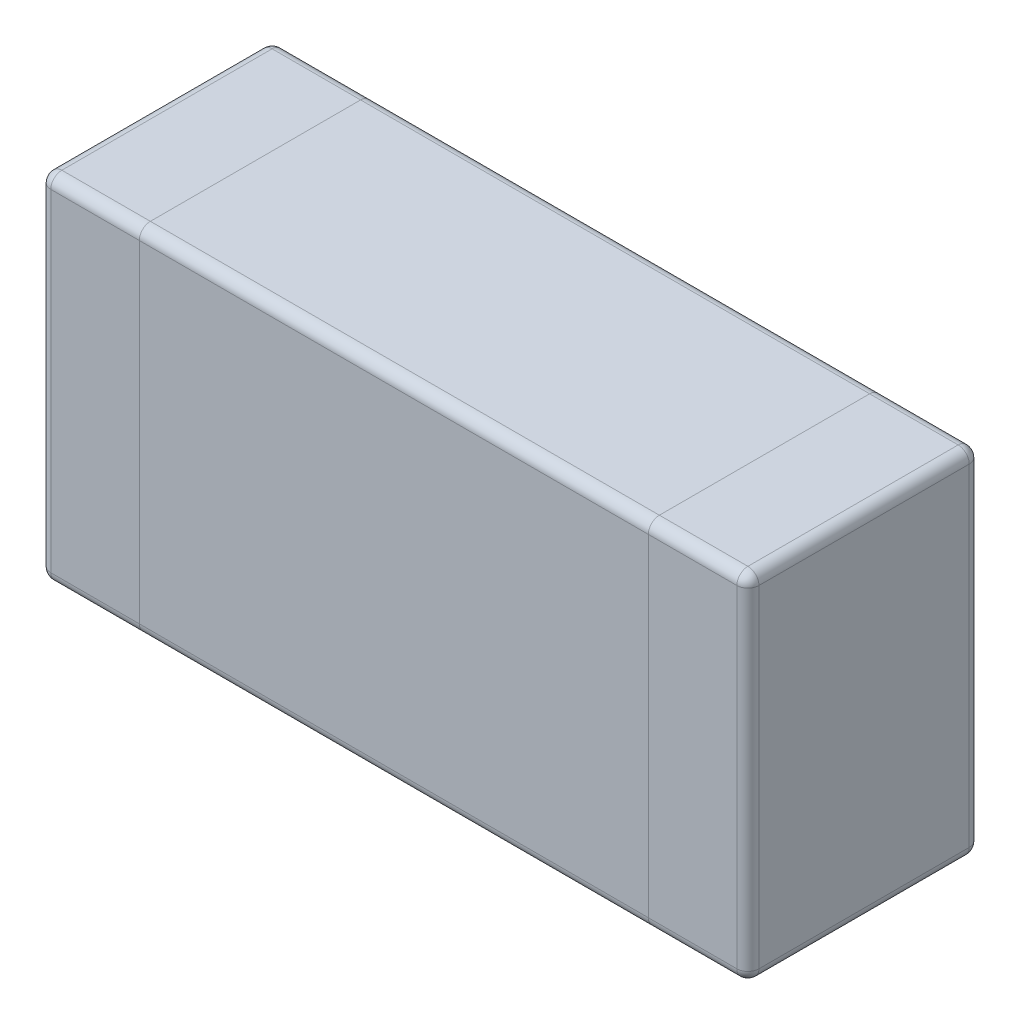
ISO-10303-21;
HEADER;
FILE_DESCRIPTION(('STEP AP214'),'2;1');
FILE_NAME('part.step','',(''),(''),'','','');
FILE_SCHEMA(('AUTOMOTIVE_DESIGN { 1 0 10303 214 1 1 1 1 }'));
ENDSEC;
DATA;
#1=APPLICATION_CONTEXT('core data for automotive mechanical design processes');
#2=APPLICATION_PROTOCOL_DEFINITION('international standard','automotive_design',2000,#1);
#3=PRODUCT_CONTEXT('',#1,'mechanical');
#4=PRODUCT('Part','Part','',(#3));
#5=PRODUCT_RELATED_PRODUCT_CATEGORY('part','',(#4));
#6=PRODUCT_DEFINITION_FORMATION('','',#4);
#7=PRODUCT_DEFINITION_CONTEXT('part definition',#1,'design');
#8=PRODUCT_DEFINITION('design','',#6,#7);
#9=PRODUCT_DEFINITION_SHAPE('','',#8);
#10=(LENGTH_UNIT() NAMED_UNIT(*) SI_UNIT(.MILLI.,.METRE.));
#11=(NAMED_UNIT(*) PLANE_ANGLE_UNIT() SI_UNIT($,.RADIAN.));
#12=(NAMED_UNIT(*) SI_UNIT($,.STERADIAN.) SOLID_ANGLE_UNIT());
#13=UNCERTAINTY_MEASURE_WITH_UNIT(LENGTH_MEASURE(1.E-05),#10,'distance_accuracy_value','');
#14=(GEOMETRIC_REPRESENTATION_CONTEXT(3) GLOBAL_UNCERTAINTY_ASSIGNED_CONTEXT((#13)) GLOBAL_UNIT_ASSIGNED_CONTEXT((#10,
#11,#12)) REPRESENTATION_CONTEXT('',''));
#15=CARTESIAN_POINT('',(0.,0.,0.));
#16=DIRECTION('',(0.,0.,1.));
#17=DIRECTION('',(1.,0.,0.));
#18=AXIS2_PLACEMENT_3D('',#15,#16,#17);
#19=CARTESIAN_POINT('',(1.55,0.749999999999718,1.0500000000002));
#20=DIRECTION('',(0.,2.68882138776405E-13,-1.));
#21=DIRECTION('',(0.,1.,2.68882138776405E-13));
#22=AXIS2_PLACEMENT_3D('',#19,#20,#21);
#23=CYLINDRICAL_SURFACE('',#22,0.05);
#24=CARTESIAN_POINT('',(1.55,0.749999999999731,1.0000000000002));
#25=DIRECTION('',(0.,2.68882138776405E-13,-1.));
#26=DIRECTION('',(0.,-1.,-2.68882138776405E-13));
#27=AXIS2_PLACEMENT_3D('',#24,#25,#26);
#28=CIRCLE('',#27,0.05);
#29=CARTESIAN_POINT('',(1.55,0.799999999999731,1.00000000000021));
#30=VERTEX_POINT('',#29);
#31=CARTESIAN_POINT('',(1.6,0.749999999999731,1.0000000000002));
#32=VERTEX_POINT('',#31);
#33=EDGE_CURVE('E25',#30,#32,#28,.T.);
#34=ORIENTED_EDGE('',*,*,#33,.T.);
#35=DIRECTION('',(0.,-2.68736422004423E-13,1.));
#36=VECTOR('',#35,1.);
#37=CARTESIAN_POINT('',(1.6,0.749999999999718,1.0500000000002));
#38=LINE('',#37,#36);
#39=CARTESIAN_POINT('',(1.6,0.749999999999987,0.0500000000002015));
#40=VERTEX_POINT('',#39);
#41=EDGE_CURVE('E207',#40,#32,#38,.T.);
#42=ORIENTED_EDGE('',*,*,#41,.F.);
#43=CARTESIAN_POINT('',(1.55,0.749999999999987,0.0500000000002015));
#44=DIRECTION('',(0.,-2.68746613504845E-13,1.));
#45=DIRECTION('',(0.,1.,2.68746613504845E-13));
#46=AXIS2_PLACEMENT_3D('',#43,#44,#45);
#47=CIRCLE('',#46,0.05);
#48=CARTESIAN_POINT('',(1.55,0.799999999999987,0.0500000000002149));
#49=VERTEX_POINT('',#48);
#50=EDGE_CURVE('E11',#40,#49,#47,.T.);
#51=ORIENTED_EDGE('',*,*,#50,.T.);
#52=DIRECTION('',(0.,2.68736422004423E-13,-1.));
#53=VECTOR('',#52,1.);
#54=CARTESIAN_POINT('',(1.55,0.799999999999718,1.05000000000021));
#55=LINE('',#54,#53);
#56=EDGE_CURVE('E209',#30,#49,#55,.T.);
#57=ORIENTED_EDGE('',*,*,#56,.F.);
#58=EDGE_LOOP('',(#34,#42,#51,#57));
#59=FACE_BOUND('',#58,.T.);
#60=ADVANCED_FACE('F17',(#59),#23,.T.);
#61=CARTESIAN_POINT('',(1.55,0.749999999999987,0.0500000000002016));
#62=DIRECTION('',(0.,-2.68736422004423E-13,1.));
#63=DIRECTION('',(1.,0.,0.));
#64=AXIS2_PLACEMENT_3D('',#61,#62,#63);
#65=SPHERICAL_SURFACE('',#64,0.05);
#66=CARTESIAN_POINT('',(1.55,0.749999999999987,0.0500000000002015));
#67=DIRECTION('',(0.,1.,2.68736422004423E-13));
#68=DIRECTION('',(-1.,0.,0.));
#69=AXIS2_PLACEMENT_3D('',#66,#67,#68);
#70=CIRCLE('',#69,0.05);
#71=CARTESIAN_POINT('',(1.55,0.75,2.01552316503317E-13));
#72=VERTEX_POINT('',#71);
#73=EDGE_CURVE('E196',#40,#72,#70,.T.);
#74=ORIENTED_EDGE('',*,*,#73,.T.);
#75=CARTESIAN_POINT('',(1.55,0.749999999999987,0.0500000000002016));
#76=DIRECTION('',(1.,0.,0.));
#77=DIRECTION('',(0.,1.,2.68746613504845E-13));
#78=AXIS2_PLACEMENT_3D('',#75,#76,#77);
#79=CIRCLE('',#78,0.05);
#80=EDGE_CURVE('E274',#72,#49,#79,.T.);
#81=ORIENTED_EDGE('',*,*,#80,.T.);
#82=ORIENTED_EDGE('',*,*,#50,.F.);
#83=EDGE_LOOP('',(#74,#81,#82));
#84=FACE_BOUND('',#83,.T.);
#85=ADVANCED_FACE('F625',(#84),#65,.T.);
#86=CARTESIAN_POINT('',(1.55,0.749999999999731,1.0000000000002));
#87=DIRECTION('',(0.,-2.68736422004423E-13,1.));
#88=DIRECTION('',(1.,0.,0.));
#89=AXIS2_PLACEMENT_3D('',#86,#87,#88);
#90=SPHERICAL_SURFACE('',#89,0.05);
#91=CARTESIAN_POINT('',(1.55,0.749999999999731,1.0000000000002));
#92=DIRECTION('',(1.,0.,0.));
#93=DIRECTION('',(0.,-2.68882138776406E-13,1.));
#94=AXIS2_PLACEMENT_3D('',#91,#92,#93);
#95=CIRCLE('',#94,0.05);
#96=CARTESIAN_POINT('',(1.55,0.749999999999718,1.0500000000002));
#97=VERTEX_POINT('',#96);
#98=EDGE_CURVE('E217',#30,#97,#95,.T.);
#99=ORIENTED_EDGE('',*,*,#98,.T.);
#100=CARTESIAN_POINT('',(1.55,0.749999999999731,1.0000000000002));
#101=DIRECTION('',(0.,1.,2.68736422004423E-13));
#102=DIRECTION('',(-1.,0.,0.));
#103=AXIS2_PLACEMENT_3D('',#100,#101,#102);
#104=CIRCLE('',#103,0.05);
#105=EDGE_CURVE('E192',#97,#32,#104,.T.);
#106=ORIENTED_EDGE('',*,*,#105,.T.);
#107=ORIENTED_EDGE('',*,*,#33,.F.);
#108=EDGE_LOOP('',(#99,#106,#107));
#109=FACE_BOUND('',#108,.T.);
#110=ADVANCED_FACE('F215',(#109),#90,.T.);
#111=CARTESIAN_POINT('',(1.55,-0.800000000000014,0.0499999999997849));
#112=DIRECTION('',(0.,-1.,-2.68736422004423E-13));
#113=DIRECTION('',(1.,0.,0.));
#114=AXIS2_PLACEMENT_3D('',#111,#112,#113);
#115=CYLINDRICAL_SURFACE('',#114,0.05);
#116=CARTESIAN_POINT('',(1.55,-0.750000000000014,0.0499999999997985));
#117=DIRECTION('',(0.,1.,2.68736422004423E-13));
#118=DIRECTION('',(1.,0.,0.));
#119=AXIS2_PLACEMENT_3D('',#116,#117,#118);
#120=CIRCLE('',#119,0.05);
#121=CARTESIAN_POINT('',(1.6,-0.750000000000014,0.0499999999997984));
#122=VERTEX_POINT('',#121);
#123=CARTESIAN_POINT('',(1.55,-0.75,-2.01552316503317E-13));
#124=VERTEX_POINT('',#123);
#125=EDGE_CURVE('E197',#122,#124,#120,.T.);
#126=ORIENTED_EDGE('',*,*,#125,.T.);
#127=DIRECTION('',(0.,-1.,-2.68736422004423E-13));
#128=VECTOR('',#127,1.);
#129=CARTESIAN_POINT('',(1.55,-0.8,-2.14989137603538E-13));
#130=LINE('',#129,#128);
#131=EDGE_CURVE('E327',#72,#124,#130,.T.);
#132=ORIENTED_EDGE('',*,*,#131,.F.);
#133=ORIENTED_EDGE('',*,*,#73,.F.);
#134=DIRECTION('',(0.,1.,2.68736422004423E-13));
#135=VECTOR('',#134,1.);
#136=CARTESIAN_POINT('',(1.6,0.799999999999987,0.0500000000002149));
#137=LINE('',#136,#135);
#138=EDGE_CURVE('E233',#122,#40,#137,.T.);
#139=ORIENTED_EDGE('',*,*,#138,.F.);
#140=EDGE_LOOP('',(#126,#132,#133,#139));
#141=FACE_BOUND('',#140,.T.);
#142=ADVANCED_FACE('F622',(#141),#115,.T.);
#143=CARTESIAN_POINT('',(-1.6,0.749999999999987,0.0500000000002015));
#144=DIRECTION('',(1.,0.,0.));
#145=DIRECTION('',(0.,1.,2.68746613504845E-13));
#146=AXIS2_PLACEMENT_3D('',#143,#144,#145);
#147=CYLINDRICAL_SURFACE('',#146,0.05);
#148=CARTESIAN_POINT('',(-1.15,0.749999999999987,0.0500000000002015));
#149=DIRECTION('',(-1.,0.,0.));
#150=DIRECTION('',(0.,1.,2.68746613504845E-13));
#151=AXIS2_PLACEMENT_3D('',#148,#149,#150);
#152=CIRCLE('',#151,0.05);
#153=CARTESIAN_POINT('',(-1.15,0.799999999999987,0.0500000000002149));
#154=VERTEX_POINT('',#153);
#155=CARTESIAN_POINT('',(-1.15,0.75,2.01552316503317E-13));
#156=VERTEX_POINT('',#155);
#157=EDGE_CURVE('E278',#154,#156,#152,.T.);
#158=ORIENTED_EDGE('',*,*,#157,.F.);
#159=DIRECTION('',(-1.,0.,0.));
#160=VECTOR('',#159,1.);
#161=CARTESIAN_POINT('',(-1.6,0.799999999999987,0.0500000000002149));
#162=LINE('',#161,#160);
#163=CARTESIAN_POINT('',(1.15,0.799999999999987,0.0500000000002149));
#164=VERTEX_POINT('',#163);
#165=EDGE_CURVE('E155',#164,#154,#162,.T.);
#166=ORIENTED_EDGE('',*,*,#165,.F.);
#167=CARTESIAN_POINT('',(1.15,0.749999999999987,0.0500000000002015));
#168=DIRECTION('',(1.,0.,0.));
#169=DIRECTION('',(0.,-1.,-2.68746613504845E-13));
#170=AXIS2_PLACEMENT_3D('',#167,#168,#169);
#171=CIRCLE('',#170,0.05);
#172=CARTESIAN_POINT('',(1.15,0.75,2.01552316503317E-13));
#173=VERTEX_POINT('',#172);
#174=EDGE_CURVE('E313',#173,#164,#171,.T.);
#175=ORIENTED_EDGE('',*,*,#174,.F.);
#176=DIRECTION('',(1.,0.,0.));
#177=VECTOR('',#176,1.);
#178=CARTESIAN_POINT('',(1.6,0.75,2.01552316503317E-13));
#179=LINE('',#178,#177);
#180=EDGE_CURVE('E174',#156,#173,#179,.T.);
#181=ORIENTED_EDGE('',*,*,#180,.F.);
#182=EDGE_LOOP('',(#158,#166,#175,#181));
#183=FACE_BOUND('',#182,.T.);
#184=ADVANCED_FACE('F279',(#183),#147,.T.);
#185=CARTESIAN_POINT('',(1.6,0.749999999999731,1.0000000000002));
#186=DIRECTION('',(-1.,0.,0.));
#187=DIRECTION('',(0.,-1.,-2.68882138776405E-13));
#188=AXIS2_PLACEMENT_3D('',#185,#186,#187);
#189=CYLINDRICAL_SURFACE('',#188,0.05);
#190=CARTESIAN_POINT('',(-1.15,0.749999999999731,1.0000000000002));
#191=DIRECTION('',(-1.,0.,0.));
#192=DIRECTION('',(0.,1.,2.68882138776405E-13));
#193=AXIS2_PLACEMENT_3D('',#190,#191,#192);
#194=CIRCLE('',#193,0.05);
#195=CARTESIAN_POINT('',(-1.15,0.749999999999718,1.0500000000002));
#196=VERTEX_POINT('',#195);
#197=CARTESIAN_POINT('',(-1.15,0.799999999999731,1.00000000000021));
#198=VERTEX_POINT('',#197);
#199=EDGE_CURVE('E331',#196,#198,#194,.T.);
#200=ORIENTED_EDGE('',*,*,#199,.F.);
#201=DIRECTION('',(-1.,0.,0.));
#202=VECTOR('',#201,1.);
#203=CARTESIAN_POINT('',(1.6,0.749999999999718,1.0500000000002));
#204=LINE('',#203,#202);
#205=CARTESIAN_POINT('',(1.15,0.749999999999718,1.0500000000002));
#206=VERTEX_POINT('',#205);
#207=EDGE_CURVE('E165',#206,#196,#204,.T.);
#208=ORIENTED_EDGE('',*,*,#207,.F.);
#209=CARTESIAN_POINT('',(1.15,0.749999999999731,1.0000000000002));
#210=DIRECTION('',(1.,0.,0.));
#211=DIRECTION('',(0.,-1.,-2.68882138776405E-13));
#212=AXIS2_PLACEMENT_3D('',#209,#210,#211);
#213=CIRCLE('',#212,0.05);
#214=CARTESIAN_POINT('',(1.15,0.799999999999731,1.00000000000021));
#215=VERTEX_POINT('',#214);
#216=EDGE_CURVE('E295',#215,#206,#213,.T.);
#217=ORIENTED_EDGE('',*,*,#216,.F.);
#218=DIRECTION('',(1.,0.,0.));
#219=VECTOR('',#218,1.);
#220=CARTESIAN_POINT('',(-1.6,0.799999999999731,1.00000000000021));
#221=LINE('',#220,#219);
#222=EDGE_CURVE('E146',#198,#215,#221,.T.);
#223=ORIENTED_EDGE('',*,*,#222,.F.);
#224=EDGE_LOOP('',(#200,#208,#217,#223));
#225=FACE_BOUND('',#224,.T.);
#226=ADVANCED_FACE('F612',(#225),#189,.T.);
#227=CARTESIAN_POINT('',(1.55,0.799999999999731,1.00000000000021));
#228=DIRECTION('',(0.,1.,2.68736422004423E-13));
#229=DIRECTION('',(-1.,0.,0.));
#230=AXIS2_PLACEMENT_3D('',#227,#228,#229);
#231=CYLINDRICAL_SURFACE('',#230,0.05);
#232=CARTESIAN_POINT('',(1.55,-0.750000000000269,0.999999999999799));
#233=DIRECTION('',(0.,1.,2.71050543121376E-13));
#234=DIRECTION('',(0.,2.71050543121376E-13,-1.));
#235=AXIS2_PLACEMENT_3D('',#232,#233,#234);
#236=CIRCLE('',#235,0.05);
#237=CARTESIAN_POINT('',(1.55,-0.750000000000283,1.0499999999998));
#238=VERTEX_POINT('',#237);
#239=CARTESIAN_POINT('',(1.6,-0.750000000000269,0.999999999999799));
#240=VERTEX_POINT('',#239);
#241=EDGE_CURVE('E191',#238,#240,#236,.T.);
#242=ORIENTED_EDGE('',*,*,#241,.T.);
#243=DIRECTION('',(0.,-1.,-2.68736422004423E-13));
#244=VECTOR('',#243,1.);
#245=CARTESIAN_POINT('',(1.6,-0.800000000000269,0.999999999999786));
#246=LINE('',#245,#244);
#247=EDGE_CURVE('E222',#32,#240,#246,.T.);
#248=ORIENTED_EDGE('',*,*,#247,.F.);
#249=ORIENTED_EDGE('',*,*,#105,.F.);
#250=DIRECTION('',(0.,1.,2.68736422004423E-13));
#251=VECTOR('',#250,1.);
#252=CARTESIAN_POINT('',(1.55,0.799999999999718,1.05000000000021));
#253=LINE('',#252,#251);
#254=EDGE_CURVE('E425',#238,#97,#253,.T.);
#255=ORIENTED_EDGE('',*,*,#254,.F.);
#256=EDGE_LOOP('',(#242,#248,#249,#255));
#257=FACE_BOUND('',#256,.T.);
#258=ADVANCED_FACE('F223',(#257),#231,.T.);
#259=CARTESIAN_POINT('',(1.55,-0.750000000000014,0.0499999999997985));
#260=DIRECTION('',(0.,-2.68736422004423E-13,1.));
#261=DIRECTION('',(1.,0.,0.));
#262=AXIS2_PLACEMENT_3D('',#259,#260,#261);
#263=SPHERICAL_SURFACE('',#262,0.05);
#264=CARTESIAN_POINT('',(1.55,-0.750000000000014,0.0499999999997984));
#265=DIRECTION('',(0.,2.68746613504845E-13,-1.));
#266=DIRECTION('',(0.,1.,2.68746613504845E-13));
#267=AXIS2_PLACEMENT_3D('',#264,#265,#266);
#268=CIRCLE('',#267,0.05);
#269=CARTESIAN_POINT('',(1.55,-0.800000000000014,0.0499999999997849));
#270=VERTEX_POINT('',#269);
#271=EDGE_CURVE('E187',#122,#270,#268,.T.);
#272=ORIENTED_EDGE('',*,*,#271,.T.);
#273=CARTESIAN_POINT('',(1.55,-0.750000000000014,0.0499999999997984));
#274=DIRECTION('',(1.,0.,0.));
#275=DIRECTION('',(0.,1.,2.68746613504845E-13));
#276=AXIS2_PLACEMENT_3D('',#273,#274,#275);
#277=CIRCLE('',#276,0.05);
#278=EDGE_CURVE('E300',#270,#124,#277,.T.);
#279=ORIENTED_EDGE('',*,*,#278,.T.);
#280=ORIENTED_EDGE('',*,*,#125,.F.);
#281=EDGE_LOOP('',(#272,#279,#280));
#282=FACE_BOUND('',#281,.T.);
#283=ADVANCED_FACE('F620',(#282),#263,.T.);
#284=CARTESIAN_POINT('',(-1.55,0.749999999999987,0.0500000000002016));
#285=DIRECTION('',(0.,-2.68736422004423E-13,1.));
#286=DIRECTION('',(1.,0.,0.));
#287=AXIS2_PLACEMENT_3D('',#284,#285,#286);
#288=SPHERICAL_SURFACE('',#287,0.05);
#289=CARTESIAN_POINT('',(-1.55,0.749999999999987,0.0500000000002016));
#290=DIRECTION('',(0.,1.,2.68736422004423E-13));
#291=DIRECTION('',(-1.,0.,0.));
#292=AXIS2_PLACEMENT_3D('',#289,#290,#291);
#293=CIRCLE('',#292,0.05);
#294=CARTESIAN_POINT('',(-1.55,0.75,2.01552316503317E-13));
#295=VERTEX_POINT('',#294);
#296=CARTESIAN_POINT('',(-1.6,0.749999999999987,0.0500000000002015));
#297=VERTEX_POINT('',#296);
#298=EDGE_CURVE('E38',#295,#297,#293,.T.);
#299=ORIENTED_EDGE('',*,*,#298,.T.);
#300=CARTESIAN_POINT('',(-1.55,0.749999999999987,0.0500000000002015));
#301=DIRECTION('',(0.,2.68746613504845E-13,-1.));
#302=DIRECTION('',(0.,1.,2.68746613504845E-13));
#303=AXIS2_PLACEMENT_3D('',#300,#301,#302);
#304=CIRCLE('',#303,0.05);
#305=CARTESIAN_POINT('',(-1.55,0.799999999999987,0.0500000000002149));
#306=VERTEX_POINT('',#305);
#307=EDGE_CURVE('E180',#297,#306,#304,.T.);
#308=ORIENTED_EDGE('',*,*,#307,.T.);
#309=CARTESIAN_POINT('',(-1.55,0.749999999999987,0.0500000000002015));
#310=DIRECTION('',(1.,0.,0.));
#311=DIRECTION('',(0.,-1.,-2.68746613504845E-13));
#312=AXIS2_PLACEMENT_3D('',#309,#310,#311);
#313=CIRCLE('',#312,0.05);
#314=EDGE_CURVE('E286',#295,#306,#313,.T.);
#315=ORIENTED_EDGE('',*,*,#314,.F.);
#316=EDGE_LOOP('',(#299,#308,#315));
#317=FACE_BOUND('',#316,.T.);
#318=ADVANCED_FACE('F640',(#317),#288,.T.);
#319=CARTESIAN_POINT('',(-1.55,0.749999999999731,1.0000000000002));
#320=DIRECTION('',(0.,-2.68736422004423E-13,1.));
#321=DIRECTION('',(1.,0.,0.));
#322=AXIS2_PLACEMENT_3D('',#319,#320,#321);
#323=SPHERICAL_SURFACE('',#322,0.05);
#324=CARTESIAN_POINT('',(-1.55,0.749999999999731,1.0000000000002));
#325=DIRECTION('',(0.,-2.68882138776405E-13,1.));
#326=DIRECTION('',(0.,-1.,-2.68882138776405E-13));
#327=AXIS2_PLACEMENT_3D('',#324,#325,#326);
#328=CIRCLE('',#327,0.05);
#329=CARTESIAN_POINT('',(-1.55,0.799999999999731,1.00000000000021));
#330=VERTEX_POINT('',#329);
#331=CARTESIAN_POINT('',(-1.6,0.749999999999732,1.0000000000002));
#332=VERTEX_POINT('',#331);
#333=EDGE_CURVE('E52',#330,#332,#328,.T.);
#334=ORIENTED_EDGE('',*,*,#333,.T.);
#335=CARTESIAN_POINT('',(-1.55,0.749999999999732,1.0000000000002));
#336=DIRECTION('',(0.,1.,2.71050543121376E-13));
#337=DIRECTION('',(0.,-2.71050543121376E-13,1.));
#338=AXIS2_PLACEMENT_3D('',#335,#336,#337);
#339=CIRCLE('',#338,0.05);
#340=CARTESIAN_POINT('',(-1.55,0.749999999999718,1.0500000000002));
#341=VERTEX_POINT('',#340);
#342=EDGE_CURVE('E115',#332,#341,#339,.T.);
#343=ORIENTED_EDGE('',*,*,#342,.T.);
#344=CARTESIAN_POINT('',(-1.55,0.749999999999731,1.0000000000002));
#345=DIRECTION('',(1.,0.,0.));
#346=DIRECTION('',(0.,-1.,-2.68882138776405E-13));
#347=AXIS2_PLACEMENT_3D('',#344,#345,#346);
#348=CIRCLE('',#347,0.05);
#349=EDGE_CURVE('E334',#330,#341,#348,.T.);
#350=ORIENTED_EDGE('',*,*,#349,.F.);
#351=EDGE_LOOP('',(#334,#343,#350));
#352=FACE_BOUND('',#351,.T.);
#353=ADVANCED_FACE('F371',(#352),#323,.T.);
#354=CARTESIAN_POINT('',(1.55,-0.750000000000269,0.999999999999799));
#355=DIRECTION('',(0.,-2.68736422004423E-13,1.));
#356=DIRECTION('',(1.,0.,0.));
#357=AXIS2_PLACEMENT_3D('',#354,#355,#356);
#358=SPHERICAL_SURFACE('',#357,0.05);
#359=CARTESIAN_POINT('',(1.55,-0.750000000000269,0.999999999999799));
#360=DIRECTION('',(1.,0.,0.));
#361=DIRECTION('',(0.,1.,2.68882138776405E-13));
#362=AXIS2_PLACEMENT_3D('',#359,#360,#361);
#363=CIRCLE('',#362,0.05);
#364=CARTESIAN_POINT('',(1.55,-0.800000000000269,0.999999999999786));
#365=VERTEX_POINT('',#364);
#366=EDGE_CURVE('E460',#238,#365,#363,.T.);
#367=ORIENTED_EDGE('',*,*,#366,.T.);
#368=CARTESIAN_POINT('',(1.55,-0.750000000000269,0.999999999999799));
#369=DIRECTION('',(0.,-2.68882138776405E-13,1.));
#370=DIRECTION('',(0.,-1.,-2.68882138776405E-13));
#371=AXIS2_PLACEMENT_3D('',#368,#369,#370);
#372=CIRCLE('',#371,0.05);
#373=EDGE_CURVE('E183',#365,#240,#372,.T.);
#374=ORIENTED_EDGE('',*,*,#373,.T.);
#375=ORIENTED_EDGE('',*,*,#241,.F.);
#376=EDGE_LOOP('',(#367,#374,#375));
#377=FACE_BOUND('',#376,.T.);
#378=ADVANCED_FACE('F639',(#377),#358,.T.);
#379=CARTESIAN_POINT('',(1.55,-0.750000000000283,1.0499999999998));
#380=DIRECTION('',(0.,2.68882138776405E-13,-1.));
#381=DIRECTION('',(0.,1.,2.68882138776405E-13));
#382=AXIS2_PLACEMENT_3D('',#379,#380,#381);
#383=CYLINDRICAL_SURFACE('',#382,0.05);
#384=ORIENTED_EDGE('',*,*,#373,.F.);
#385=DIRECTION('',(0.,-2.68736422004423E-13,1.));
#386=VECTOR('',#385,1.);
#387=CARTESIAN_POINT('',(1.55,-0.800000000000282,1.04999999999979));
#388=LINE('',#387,#386);
#389=EDGE_CURVE('E475',#270,#365,#388,.T.);
#390=ORIENTED_EDGE('',*,*,#389,.F.);
#391=ORIENTED_EDGE('',*,*,#271,.F.);
#392=DIRECTION('',(0.,2.68736422004423E-13,-1.));
#393=VECTOR('',#392,1.);
#394=CARTESIAN_POINT('',(1.6,-0.750000000000283,1.0499999999998));
#395=LINE('',#394,#393);
#396=EDGE_CURVE('E228',#240,#122,#395,.T.);
#397=ORIENTED_EDGE('',*,*,#396,.F.);
#398=EDGE_LOOP('',(#384,#390,#391,#397));
#399=FACE_BOUND('',#398,.T.);
#400=ADVANCED_FACE('F657',(#399),#383,.T.);
#401=CARTESIAN_POINT('',(-1.6,-0.750000000000014,0.0499999999997984));
#402=DIRECTION('',(-1.,0.,0.));
#403=DIRECTION('',(0.,-1.,-2.68746613504845E-13));
#404=AXIS2_PLACEMENT_3D('',#401,#402,#403);
#405=CYLINDRICAL_SURFACE('',#404,0.05);
#406=CARTESIAN_POINT('',(-1.15,-0.750000000000014,0.0499999999997984));
#407=DIRECTION('',(-1.,0.,0.));
#408=DIRECTION('',(0.,1.,2.68746613504845E-13));
#409=AXIS2_PLACEMENT_3D('',#406,#407,#408);
#410=CIRCLE('',#409,0.05);
#411=CARTESIAN_POINT('',(-1.15,-0.75,-2.01552316503317E-13));
#412=VERTEX_POINT('',#411);
#413=CARTESIAN_POINT('',(-1.15,-0.800000000000014,0.0499999999997849));
#414=VERTEX_POINT('',#413);
#415=EDGE_CURVE('E478',#412,#414,#410,.T.);
#416=ORIENTED_EDGE('',*,*,#415,.F.);
#417=DIRECTION('',(-1.,0.,0.));
#418=VECTOR('',#417,1.);
#419=CARTESIAN_POINT('',(-1.6,-0.75,-2.01552316503317E-13));
#420=LINE('',#419,#418);
#421=CARTESIAN_POINT('',(1.15,-0.75,-2.01552316503317E-13));
#422=VERTEX_POINT('',#421);
#423=EDGE_CURVE('E170',#422,#412,#420,.T.);
#424=ORIENTED_EDGE('',*,*,#423,.F.);
#425=CARTESIAN_POINT('',(1.15,-0.750000000000014,0.0499999999997984));
#426=DIRECTION('',(1.,0.,0.));
#427=DIRECTION('',(0.,-1.,-2.68746613504845E-13));
#428=AXIS2_PLACEMENT_3D('',#425,#426,#427);
#429=CIRCLE('',#428,0.05);
#430=CARTESIAN_POINT('',(1.15,-0.800000000000014,0.0499999999997849));
#431=VERTEX_POINT('',#430);
#432=EDGE_CURVE('E309',#431,#422,#429,.T.);
#433=ORIENTED_EDGE('',*,*,#432,.F.);
#434=DIRECTION('',(1.,0.,0.));
#435=VECTOR('',#434,1.);
#436=CARTESIAN_POINT('',(1.6,-0.800000000000014,0.0499999999997849));
#437=LINE('',#436,#435);
#438=EDGE_CURVE('E161',#414,#431,#437,.T.);
#439=ORIENTED_EDGE('',*,*,#438,.F.);
#440=EDGE_LOOP('',(#416,#424,#433,#439));
#441=FACE_BOUND('',#440,.T.);
#442=ADVANCED_FACE('F508',(#441),#405,.T.);
#443=CARTESIAN_POINT('',(-1.55,-0.800000000000014,0.0499999999997849));
#444=DIRECTION('',(0.,1.,2.68736422004423E-13));
#445=DIRECTION('',(-1.,0.,0.));
#446=AXIS2_PLACEMENT_3D('',#443,#444,#445);
#447=CYLINDRICAL_SURFACE('',#446,0.05);
#448=CARTESIAN_POINT('',(-1.55,-0.750000000000014,0.0499999999997984));
#449=DIRECTION('',(0.,1.,2.68736422004423E-13));
#450=DIRECTION('',(1.,0.,0.));
#451=AXIS2_PLACEMENT_3D('',#448,#449,#450);
#452=CIRCLE('',#451,0.05);
#453=CARTESIAN_POINT('',(-1.55,-0.75,-2.01552316503317E-13));
#454=VERTEX_POINT('',#453);
#455=CARTESIAN_POINT('',(-1.6,-0.750000000000014,0.0499999999997984));
#456=VERTEX_POINT('',#455);
#457=EDGE_CURVE('E102',#454,#456,#452,.T.);
#458=ORIENTED_EDGE('',*,*,#457,.T.);
#459=DIRECTION('',(0.,-1.,-2.68736422004423E-13));
#460=VECTOR('',#459,1.);
#461=CARTESIAN_POINT('',(-1.6,-0.800000000000014,0.0499999999997849));
#462=LINE('',#461,#460);
#463=EDGE_CURVE('E106',#297,#456,#462,.T.);
#464=ORIENTED_EDGE('',*,*,#463,.F.);
#465=ORIENTED_EDGE('',*,*,#298,.F.);
#466=DIRECTION('',(0.,1.,2.68736422004423E-13));
#467=VECTOR('',#466,1.);
#468=CARTESIAN_POINT('',(-1.55,0.8,2.14989137603538E-13));
#469=LINE('',#468,#467);
#470=EDGE_CURVE('E110',#454,#295,#469,.T.);
#471=ORIENTED_EDGE('',*,*,#470,.F.);
#472=EDGE_LOOP('',(#458,#464,#465,#471));
#473=FACE_BOUND('',#472,.T.);
#474=ADVANCED_FACE('F104',(#473),#447,.T.);
#475=CARTESIAN_POINT('',(-1.55,0.749999999999718,1.0500000000002));
#476=DIRECTION('',(0.,2.68882138776405E-13,-1.));
#477=DIRECTION('',(0.,1.,2.68882138776405E-13));
#478=AXIS2_PLACEMENT_3D('',#475,#476,#477);
#479=CYLINDRICAL_SURFACE('',#478,0.05);
#480=ORIENTED_EDGE('',*,*,#307,.F.);
#481=DIRECTION('',(0.,2.68736422004423E-13,-1.));
#482=VECTOR('',#481,1.);
#483=CARTESIAN_POINT('',(-1.6,0.749999999999718,1.0500000000002));
#484=LINE('',#483,#482);
#485=EDGE_CURVE('E136',#332,#297,#484,.T.);
#486=ORIENTED_EDGE('',*,*,#485,.F.);
#487=ORIENTED_EDGE('',*,*,#333,.F.);
#488=DIRECTION('',(0.,-2.68736422004423E-13,1.));
#489=VECTOR('',#488,1.);
#490=CARTESIAN_POINT('',(-1.55,0.799999999999718,1.05000000000021));
#491=LINE('',#490,#489);
#492=EDGE_CURVE('E273',#306,#330,#491,.T.);
#493=ORIENTED_EDGE('',*,*,#492,.F.);
#494=EDGE_LOOP('',(#480,#486,#487,#493));
#495=FACE_BOUND('',#494,.T.);
#496=ADVANCED_FACE('F649',(#495),#479,.T.);
#497=CARTESIAN_POINT('',(-1.55,0.799999999999731,1.00000000000021));
#498=DIRECTION('',(0.,-1.,-2.68736422004423E-13));
#499=DIRECTION('',(1.,0.,0.));
#500=AXIS2_PLACEMENT_3D('',#497,#498,#499);
#501=CYLINDRICAL_SURFACE('',#500,0.05);
#502=CARTESIAN_POINT('',(-1.55,-0.750000000000269,0.999999999999799));
#503=DIRECTION('',(0.,1.,2.68736422004423E-13));
#504=DIRECTION('',(1.,0.,0.));
#505=AXIS2_PLACEMENT_3D('',#502,#503,#504);
#506=CIRCLE('',#505,0.05);
#507=CARTESIAN_POINT('',(-1.6,-0.750000000000269,0.999999999999799));
#508=VERTEX_POINT('',#507);
#509=CARTESIAN_POINT('',(-1.55,-0.750000000000283,1.0499999999998));
#510=VERTEX_POINT('',#509);
#511=EDGE_CURVE('E116',#508,#510,#506,.T.);
#512=ORIENTED_EDGE('',*,*,#511,.T.);
#513=DIRECTION('',(0.,-1.,-2.68736422004423E-13));
#514=VECTOR('',#513,1.);
#515=CARTESIAN_POINT('',(-1.55,0.799999999999718,1.05000000000021));
#516=LINE('',#515,#514);
#517=EDGE_CURVE('E386',#341,#510,#516,.T.);
#518=ORIENTED_EDGE('',*,*,#517,.F.);
#519=ORIENTED_EDGE('',*,*,#342,.F.);
#520=DIRECTION('',(0.,1.,2.68736422004423E-13));
#521=VECTOR('',#520,1.);
#522=CARTESIAN_POINT('',(-1.6,-0.800000000000269,0.999999999999786));
#523=LINE('',#522,#521);
#524=EDGE_CURVE('E145',#508,#332,#523,.T.);
#525=ORIENTED_EDGE('',*,*,#524,.F.);
#526=EDGE_LOOP('',(#512,#518,#519,#525));
#527=FACE_BOUND('',#526,.T.);
#528=ADVANCED_FACE('F387',(#527),#501,.T.);
#529=CARTESIAN_POINT('',(1.6,-0.750000000000269,0.999999999999799));
#530=DIRECTION('',(1.,0.,0.));
#531=DIRECTION('',(0.,1.,2.68882138776405E-13));
#532=AXIS2_PLACEMENT_3D('',#529,#530,#531);
#533=CYLINDRICAL_SURFACE('',#532,0.05);
#534=CARTESIAN_POINT('',(-1.15,-0.750000000000269,0.999999999999799));
#535=DIRECTION('',(-1.,0.,0.));
#536=DIRECTION('',(0.,1.,2.68882138776405E-13));
#537=AXIS2_PLACEMENT_3D('',#534,#535,#536);
#538=CIRCLE('',#537,0.05);
#539=CARTESIAN_POINT('',(-1.15,-0.800000000000269,0.999999999999786));
#540=VERTEX_POINT('',#539);
#541=CARTESIAN_POINT('',(-1.15,-0.750000000000283,1.0499999999998));
#542=VERTEX_POINT('',#541);
#543=EDGE_CURVE('E431',#540,#542,#538,.T.);
#544=ORIENTED_EDGE('',*,*,#543,.F.);
#545=DIRECTION('',(-1.,0.,0.));
#546=VECTOR('',#545,1.);
#547=CARTESIAN_POINT('',(-1.6,-0.800000000000269,0.999999999999786));
#548=LINE('',#547,#546);
#549=CARTESIAN_POINT('',(1.15,-0.800000000000269,0.999999999999786));
#550=VERTEX_POINT('',#549);
#551=EDGE_CURVE('E138',#550,#540,#548,.T.);
#552=ORIENTED_EDGE('',*,*,#551,.F.);
#553=CARTESIAN_POINT('',(1.15,-0.750000000000269,0.999999999999799));
#554=DIRECTION('',(1.,0.,0.));
#555=DIRECTION('',(0.,-1.,-2.68882138776405E-13));
#556=AXIS2_PLACEMENT_3D('',#553,#554,#555);
#557=CIRCLE('',#556,0.05);
#558=CARTESIAN_POINT('',(1.15,-0.750000000000283,1.0499999999998));
#559=VERTEX_POINT('',#558);
#560=EDGE_CURVE('E430',#559,#550,#557,.T.);
#561=ORIENTED_EDGE('',*,*,#560,.F.);
#562=DIRECTION('',(1.,0.,0.));
#563=VECTOR('',#562,1.);
#564=CARTESIAN_POINT('',(1.6,-0.750000000000283,1.0499999999998));
#565=LINE('',#564,#563);
#566=EDGE_CURVE('E169',#542,#559,#565,.T.);
#567=ORIENTED_EDGE('',*,*,#566,.F.);
#568=EDGE_LOOP('',(#544,#552,#561,#567));
#569=FACE_BOUND('',#568,.T.);
#570=ADVANCED_FACE('F603',(#569),#533,.T.);
#571=CARTESIAN_POINT('',(-1.55,-0.750000000000014,0.0499999999997985));
#572=DIRECTION('',(0.,-2.68736422004423E-13,1.));
#573=DIRECTION('',(1.,0.,0.));
#574=AXIS2_PLACEMENT_3D('',#571,#572,#573);
#575=SPHERICAL_SURFACE('',#574,0.05);
#576=CARTESIAN_POINT('',(-1.55,-0.750000000000014,0.0499999999997985));
#577=DIRECTION('',(1.,0.,0.));
#578=DIRECTION('',(0.,-1.,-2.70508442035133E-13));
#579=AXIS2_PLACEMENT_3D('',#576,#577,#578);
#580=CIRCLE('',#579,0.05);
#581=CARTESIAN_POINT('',(-1.55,-0.800000000000014,0.0499999999997849));
#582=VERTEX_POINT('',#581);
#583=EDGE_CURVE('E122',#582,#454,#580,.T.);
#584=ORIENTED_EDGE('',*,*,#583,.F.);
#585=CARTESIAN_POINT('',(-1.55,-0.750000000000014,0.0499999999997984));
#586=DIRECTION('',(0.,2.68746613504845E-13,-1.));
#587=DIRECTION('',(0.,1.,2.68746613504845E-13));
#588=AXIS2_PLACEMENT_3D('',#585,#586,#587);
#589=CIRCLE('',#588,0.05);
#590=EDGE_CURVE('E119',#582,#456,#589,.T.);
#591=ORIENTED_EDGE('',*,*,#590,.T.);
#592=ORIENTED_EDGE('',*,*,#457,.F.);
#593=EDGE_LOOP('',(#584,#591,#592));
#594=FACE_BOUND('',#593,.T.);
#595=ADVANCED_FACE('F120',(#594),#575,.T.);
#596=CARTESIAN_POINT('',(-1.55,-0.750000000000269,0.999999999999799));
#597=DIRECTION('',(0.,-2.68736422004423E-13,1.));
#598=DIRECTION('',(1.,0.,0.));
#599=AXIS2_PLACEMENT_3D('',#596,#597,#598);
#600=SPHERICAL_SURFACE('',#599,0.05);
#601=ORIENTED_EDGE('',*,*,#511,.F.);
#602=CARTESIAN_POINT('',(-1.55,-0.750000000000269,0.999999999999799));
#603=DIRECTION('',(0.,-2.68882138776405E-13,1.));
#604=DIRECTION('',(0.,-1.,-2.68882138776405E-13));
#605=AXIS2_PLACEMENT_3D('',#602,#603,#604);
#606=CIRCLE('',#605,0.05);
#607=CARTESIAN_POINT('',(-1.55,-0.800000000000269,0.999999999999786));
#608=VERTEX_POINT('',#607);
#609=EDGE_CURVE('E128',#508,#608,#606,.T.);
#610=ORIENTED_EDGE('',*,*,#609,.T.);
#611=CARTESIAN_POINT('',(-1.55,-0.750000000000269,0.999999999999799));
#612=DIRECTION('',(1.,0.,0.));
#613=DIRECTION('',(0.,2.68882138776405E-13,-1.));
#614=AXIS2_PLACEMENT_3D('',#611,#612,#613);
#615=CIRCLE('',#614,0.05);
#616=EDGE_CURVE('E426',#510,#608,#615,.T.);
#617=ORIENTED_EDGE('',*,*,#616,.F.);
#618=EDGE_LOOP('',(#601,#610,#617));
#619=FACE_BOUND('',#618,.T.);
#620=ADVANCED_FACE('F591',(#619),#600,.T.);
#621=CARTESIAN_POINT('',(-1.55,-0.750000000000283,1.0499999999998));
#622=DIRECTION('',(0.,2.68882138776405E-13,-1.));
#623=DIRECTION('',(0.,1.,2.68882138776405E-13));
#624=AXIS2_PLACEMENT_3D('',#621,#622,#623);
#625=CYLINDRICAL_SURFACE('',#624,0.05);
#626=ORIENTED_EDGE('',*,*,#609,.F.);
#627=DIRECTION('',(0.,-2.68736422004423E-13,1.));
#628=VECTOR('',#627,1.);
#629=CARTESIAN_POINT('',(-1.6,-0.750000000000283,1.0499999999998));
#630=LINE('',#629,#628);
#631=EDGE_CURVE('E134',#456,#508,#630,.T.);
#632=ORIENTED_EDGE('',*,*,#631,.F.);
#633=ORIENTED_EDGE('',*,*,#590,.F.);
#634=DIRECTION('',(0.,2.68736422004423E-13,-1.));
#635=VECTOR('',#634,1.);
#636=CARTESIAN_POINT('',(-1.55,-0.800000000000282,1.04999999999979));
#637=LINE('',#636,#635);
#638=EDGE_CURVE('E406',#608,#582,#637,.T.);
#639=ORIENTED_EDGE('',*,*,#638,.F.);
#640=EDGE_LOOP('',(#626,#632,#633,#639));
#641=FACE_BOUND('',#640,.T.);
#642=ADVANCED_FACE('F141',(#641),#625,.T.);
#643=CARTESIAN_POINT('',(1.6,0.8,2.14989137603538E-13));
#644=DIRECTION('',(0.,2.68736422004423E-13,-1.));
#645=DIRECTION('',(-1.,0.,0.));
#646=AXIS2_PLACEMENT_3D('',#643,#644,#645);
#647=PLANE('',#646);
#648=DIRECTION('',(0.,-1.,-2.68736422004423E-13));
#649=VECTOR('',#648,1.);
#650=CARTESIAN_POINT('',(-1.15,0.8,2.14989137603538E-13));
#651=LINE('',#650,#649);
#652=EDGE_CURVE('E316',#156,#412,#651,.T.);
#653=ORIENTED_EDGE('',*,*,#652,.F.);
#654=ORIENTED_EDGE('',*,*,#180,.T.);
#655=DIRECTION('',(0.,1.,2.68736422004423E-13));
#656=VECTOR('',#655,1.);
#657=CARTESIAN_POINT('',(1.15,0.8,2.14989137603538E-13));
#658=LINE('',#657,#656);
#659=EDGE_CURVE('E322',#422,#173,#658,.T.);
#660=ORIENTED_EDGE('',*,*,#659,.F.);
#661=ORIENTED_EDGE('',*,*,#423,.T.);
#662=EDGE_LOOP('',(#653,#654,#660,#661));
#663=FACE_BOUND('',#662,.T.);
#664=ADVANCED_FACE('F681',(#663),#647,.T.);
#665=CARTESIAN_POINT('',(1.6,0.799999999999718,1.05000000000021));
#666=DIRECTION('',(0.,2.68736422004423E-13,-1.));
#667=DIRECTION('',(-1.,0.,0.));
#668=AXIS2_PLACEMENT_3D('',#665,#666,#667);
#669=PLANE('',#668);
#670=ORIENTED_EDGE('',*,*,#207,.T.);
#671=DIRECTION('',(0.,-1.,-2.68736422004423E-13));
#672=VECTOR('',#671,1.);
#673=CARTESIAN_POINT('',(-1.15,0.799999999999718,1.05000000000021));
#674=LINE('',#673,#672);
#675=EDGE_CURVE('E396',#196,#542,#674,.T.);
#676=ORIENTED_EDGE('',*,*,#675,.T.);
#677=ORIENTED_EDGE('',*,*,#566,.T.);
#678=DIRECTION('',(0.,1.,2.68736422004423E-13));
#679=VECTOR('',#678,1.);
#680=CARTESIAN_POINT('',(1.15,0.799999999999718,1.05000000000021));
#681=LINE('',#680,#679);
#682=EDGE_CURVE('E417',#559,#206,#681,.T.);
#683=ORIENTED_EDGE('',*,*,#682,.T.);
#684=EDGE_LOOP('',(#670,#676,#677,#683));
#685=FACE_BOUND('',#684,.T.);
#686=ADVANCED_FACE('F608',(#685),#669,.F.);
#687=CARTESIAN_POINT('',(-1.6,-0.800000000000282,1.04999999999979));
#688=DIRECTION('',(0.,1.,2.68736422004423E-13));
#689=DIRECTION('',(0.,2.68736422004423E-13,-1.));
#690=AXIS2_PLACEMENT_3D('',#687,#688,#689);
#691=PLANE('',#690);
#692=ORIENTED_EDGE('',*,*,#551,.T.);
#693=DIRECTION('',(0.,2.68736422004423E-13,-1.));
#694=VECTOR('',#693,1.);
#695=CARTESIAN_POINT('',(-1.15,-0.800000000000282,1.04999999999979));
#696=LINE('',#695,#694);
#697=EDGE_CURVE('E411',#540,#414,#696,.T.);
#698=ORIENTED_EDGE('',*,*,#697,.T.);
#699=ORIENTED_EDGE('',*,*,#438,.T.);
#700=DIRECTION('',(0.,-2.68736422004423E-13,1.));
#701=VECTOR('',#700,1.);
#702=CARTESIAN_POINT('',(1.15,-0.800000000000282,1.04999999999979));
#703=LINE('',#702,#701);
#704=EDGE_CURVE('E466',#431,#550,#703,.T.);
#705=ORIENTED_EDGE('',*,*,#704,.T.);
#706=EDGE_LOOP('',(#692,#698,#699,#705));
#707=FACE_BOUND('',#706,.T.);
#708=ADVANCED_FACE('F673',(#707),#691,.F.);
#709=CARTESIAN_POINT('',(-1.6,-0.800000000000282,1.04999999999979));
#710=DIRECTION('',(1.,0.,0.));
#711=DIRECTION('',(0.,1.,0.));
#712=AXIS2_PLACEMENT_3D('',#709,#710,#711);
#713=PLANE('',#712);
#714=ORIENTED_EDGE('',*,*,#631,.T.);
#715=ORIENTED_EDGE('',*,*,#524,.T.);
#716=ORIENTED_EDGE('',*,*,#485,.T.);
#717=ORIENTED_EDGE('',*,*,#463,.T.);
#718=EDGE_LOOP('',(#714,#715,#716,#717));
#719=FACE_BOUND('',#718,.T.);
#720=ADVANCED_FACE('F132',(#719),#713,.F.);
#721=CARTESIAN_POINT('',(-1.6,0.799999999999718,1.05000000000021));
#722=DIRECTION('',(0.,-1.,-2.68736422004423E-13));
#723=DIRECTION('',(0.,2.68736422004423E-13,-1.));
#724=AXIS2_PLACEMENT_3D('',#721,#722,#723);
#725=PLANE('',#724);
#726=ORIENTED_EDGE('',*,*,#165,.T.);
#727=DIRECTION('',(0.,-2.68736422004423E-13,1.));
#728=VECTOR('',#727,1.);
#729=CARTESIAN_POINT('',(-1.15,0.799999999999718,1.05000000000021));
#730=LINE('',#729,#728);
#731=EDGE_CURVE('E256',#154,#198,#730,.T.);
#732=ORIENTED_EDGE('',*,*,#731,.T.);
#733=ORIENTED_EDGE('',*,*,#222,.T.);
#734=DIRECTION('',(0.,2.68736422004423E-13,-1.));
#735=VECTOR('',#734,1.);
#736=CARTESIAN_POINT('',(1.15,0.799999999999718,1.05000000000021));
#737=LINE('',#736,#735);
#738=EDGE_CURVE('E239',#215,#164,#737,.T.);
#739=ORIENTED_EDGE('',*,*,#738,.T.);
#740=EDGE_LOOP('',(#726,#732,#733,#739));
#741=FACE_BOUND('',#740,.T.);
#742=ADVANCED_FACE('F254',(#741),#725,.F.);
#743=CARTESIAN_POINT('',(1.6,-0.800000000000282,1.04999999999979));
#744=DIRECTION('',(-1.,0.,0.));
#745=DIRECTION('',(0.,0.,1.));
#746=AXIS2_PLACEMENT_3D('',#743,#744,#745);
#747=PLANE('',#746);
#748=ORIENTED_EDGE('',*,*,#41,.T.);
#749=ORIENTED_EDGE('',*,*,#247,.T.);
#750=ORIENTED_EDGE('',*,*,#396,.T.);
#751=ORIENTED_EDGE('',*,*,#138,.T.);
#752=EDGE_LOOP('',(#748,#749,#750,#751));
#753=FACE_BOUND('',#752,.T.);
#754=ADVANCED_FACE('F231',(#753),#747,.F.);
#755=CARTESIAN_POINT('',(-1.6,0.799999999999718,1.05000000000021));
#756=DIRECTION('',(0.,-1.,-2.68736422004423E-13));
#757=DIRECTION('',(0.,2.68736422004423E-13,-1.));
#758=AXIS2_PLACEMENT_3D('',#755,#756,#757);
#759=PLANE('',#758);
#760=ORIENTED_EDGE('',*,*,#738,.F.);
#761=DIRECTION('',(1.,0.,0.));
#762=VECTOR('',#761,1.);
#763=CARTESIAN_POINT('',(-1.6,0.799999999999731,1.00000000000021));
#764=LINE('',#763,#762);
#765=EDGE_CURVE('E338',#215,#30,#764,.T.);
#766=ORIENTED_EDGE('',*,*,#765,.T.);
#767=ORIENTED_EDGE('',*,*,#56,.T.);
#768=DIRECTION('',(-1.,0.,0.));
#769=VECTOR('',#768,1.);
#770=CARTESIAN_POINT('',(-1.6,0.799999999999987,0.0500000000002149));
#771=LINE('',#770,#769);
#772=EDGE_CURVE('E310',#49,#164,#771,.T.);
#773=ORIENTED_EDGE('',*,*,#772,.T.);
#774=EDGE_LOOP('',(#760,#766,#767,#773));
#775=FACE_BOUND('',#774,.T.);
#776=ADVANCED_FACE('F714',(#775),#759,.F.);
#777=CARTESIAN_POINT('',(-1.6,0.799999999999718,1.05000000000021));
#778=DIRECTION('',(0.,-1.,-2.68736422004423E-13));
#779=DIRECTION('',(0.,2.68736422004423E-13,-1.));
#780=AXIS2_PLACEMENT_3D('',#777,#778,#779);
#781=PLANE('',#780);
#782=ORIENTED_EDGE('',*,*,#731,.F.);
#783=DIRECTION('',(-1.,0.,0.));
#784=VECTOR('',#783,1.);
#785=CARTESIAN_POINT('',(-1.6,0.799999999999987,0.0500000000002149));
#786=LINE('',#785,#784);
#787=EDGE_CURVE('E268',#154,#306,#786,.T.);
#788=ORIENTED_EDGE('',*,*,#787,.T.);
#789=ORIENTED_EDGE('',*,*,#492,.T.);
#790=DIRECTION('',(1.,0.,0.));
#791=VECTOR('',#790,1.);
#792=CARTESIAN_POINT('',(-1.6,0.799999999999731,1.00000000000021));
#793=LINE('',#792,#791);
#794=EDGE_CURVE('E270',#330,#198,#793,.T.);
#795=ORIENTED_EDGE('',*,*,#794,.T.);
#796=EDGE_LOOP('',(#782,#788,#789,#795));
#797=FACE_BOUND('',#796,.T.);
#798=ADVANCED_FACE('F265',(#797),#781,.F.);
#799=CARTESIAN_POINT('',(-1.6,0.749999999999987,0.0500000000002015));
#800=DIRECTION('',(1.,0.,0.));
#801=DIRECTION('',(0.,1.,2.68746613504845E-13));
#802=AXIS2_PLACEMENT_3D('',#799,#800,#801);
#803=CYLINDRICAL_SURFACE('',#802,0.05);
#804=DIRECTION('',(1.,0.,0.));
#805=VECTOR('',#804,1.);
#806=CARTESIAN_POINT('',(1.6,0.75,2.01552316503317E-13));
#807=LINE('',#806,#805);
#808=EDGE_CURVE('E323',#173,#72,#807,.T.);
#809=ORIENTED_EDGE('',*,*,#808,.F.);
#810=ORIENTED_EDGE('',*,*,#174,.T.);
#811=ORIENTED_EDGE('',*,*,#772,.F.);
#812=ORIENTED_EDGE('',*,*,#80,.F.);
#813=EDGE_LOOP('',(#809,#810,#811,#812));
#814=FACE_BOUND('',#813,.T.);
#815=ADVANCED_FACE('F720',(#814),#803,.T.);
#816=CARTESIAN_POINT('',(-1.6,0.749999999999987,0.0500000000002015));
#817=DIRECTION('',(1.,0.,0.));
#818=DIRECTION('',(0.,1.,2.68746613504845E-13));
#819=AXIS2_PLACEMENT_3D('',#816,#817,#818);
#820=CYLINDRICAL_SURFACE('',#819,0.05);
#821=ORIENTED_EDGE('',*,*,#787,.F.);
#822=ORIENTED_EDGE('',*,*,#157,.T.);
#823=DIRECTION('',(1.,0.,0.));
#824=VECTOR('',#823,1.);
#825=CARTESIAN_POINT('',(1.6,0.75,2.01552316503317E-13));
#826=LINE('',#825,#824);
#827=EDGE_CURVE('E304',#295,#156,#826,.T.);
#828=ORIENTED_EDGE('',*,*,#827,.F.);
#829=ORIENTED_EDGE('',*,*,#314,.T.);
#830=EDGE_LOOP('',(#821,#822,#828,#829));
#831=FACE_BOUND('',#830,.T.);
#832=ADVANCED_FACE('F289',(#831),#820,.T.);
#833=CARTESIAN_POINT('',(1.6,0.749999999999731,1.0000000000002));
#834=DIRECTION('',(-1.,0.,0.));
#835=DIRECTION('',(0.,-1.,-2.68882138776405E-13));
#836=AXIS2_PLACEMENT_3D('',#833,#834,#835);
#837=CYLINDRICAL_SURFACE('',#836,0.05);
#838=ORIENTED_EDGE('',*,*,#765,.F.);
#839=ORIENTED_EDGE('',*,*,#216,.T.);
#840=DIRECTION('',(-1.,0.,0.));
#841=VECTOR('',#840,1.);
#842=CARTESIAN_POINT('',(1.6,0.749999999999718,1.0500000000002));
#843=LINE('',#842,#841);
#844=EDGE_CURVE('E435',#97,#206,#843,.T.);
#845=ORIENTED_EDGE('',*,*,#844,.F.);
#846=ORIENTED_EDGE('',*,*,#98,.F.);
#847=EDGE_LOOP('',(#838,#839,#845,#846));
#848=FACE_BOUND('',#847,.T.);
#849=ADVANCED_FACE('F713',(#848),#837,.T.);
#850=CARTESIAN_POINT('',(1.6,0.749999999999731,1.0000000000002));
#851=DIRECTION('',(-1.,0.,0.));
#852=DIRECTION('',(0.,-1.,-2.68882138776405E-13));
#853=AXIS2_PLACEMENT_3D('',#850,#851,#852);
#854=CYLINDRICAL_SURFACE('',#853,0.05);
#855=DIRECTION('',(-1.,0.,0.));
#856=VECTOR('',#855,1.);
#857=CARTESIAN_POINT('',(1.6,0.749999999999718,1.0500000000002));
#858=LINE('',#857,#856);
#859=EDGE_CURVE('E383',#196,#341,#858,.T.);
#860=ORIENTED_EDGE('',*,*,#859,.F.);
#861=ORIENTED_EDGE('',*,*,#199,.T.);
#862=ORIENTED_EDGE('',*,*,#794,.F.);
#863=ORIENTED_EDGE('',*,*,#349,.T.);
#864=EDGE_LOOP('',(#860,#861,#862,#863));
#865=FACE_BOUND('',#864,.T.);
#866=ADVANCED_FACE('F380',(#865),#854,.T.);
#867=CARTESIAN_POINT('',(1.6,0.8,2.14989137603538E-13));
#868=DIRECTION('',(0.,2.68736422004423E-13,-1.));
#869=DIRECTION('',(-1.,0.,0.));
#870=AXIS2_PLACEMENT_3D('',#867,#868,#869);
#871=PLANE('',#870);
#872=DIRECTION('',(-1.,0.,0.));
#873=VECTOR('',#872,1.);
#874=CARTESIAN_POINT('',(-1.6,-0.75,-2.01552316503317E-13));
#875=LINE('',#874,#873);
#876=EDGE_CURVE('E305',#124,#422,#875,.T.);
#877=ORIENTED_EDGE('',*,*,#876,.T.);
#878=ORIENTED_EDGE('',*,*,#659,.T.);
#879=ORIENTED_EDGE('',*,*,#808,.T.);
#880=ORIENTED_EDGE('',*,*,#131,.T.);
#881=EDGE_LOOP('',(#877,#878,#879,#880));
#882=FACE_BOUND('',#881,.T.);
#883=ADVANCED_FACE('F707',(#882),#871,.T.);
#884=CARTESIAN_POINT('',(1.6,0.8,2.14989137603538E-13));
#885=DIRECTION('',(0.,2.68736422004423E-13,-1.));
#886=DIRECTION('',(-1.,0.,0.));
#887=AXIS2_PLACEMENT_3D('',#884,#885,#886);
#888=PLANE('',#887);
#889=ORIENTED_EDGE('',*,*,#827,.T.);
#890=ORIENTED_EDGE('',*,*,#652,.T.);
#891=DIRECTION('',(-1.,0.,0.));
#892=VECTOR('',#891,1.);
#893=CARTESIAN_POINT('',(-1.6,-0.75,-2.01552316503317E-13));
#894=LINE('',#893,#892);
#895=EDGE_CURVE('E482',#412,#454,#894,.T.);
#896=ORIENTED_EDGE('',*,*,#895,.T.);
#897=ORIENTED_EDGE('',*,*,#470,.T.);
#898=EDGE_LOOP('',(#889,#890,#896,#897));
#899=FACE_BOUND('',#898,.T.);
#900=ADVANCED_FACE('F690',(#899),#888,.T.);
#901=CARTESIAN_POINT('',(-1.6,-0.750000000000014,0.0499999999997984));
#902=DIRECTION('',(-1.,0.,0.));
#903=DIRECTION('',(0.,-1.,-2.68746613504845E-13));
#904=AXIS2_PLACEMENT_3D('',#901,#902,#903);
#905=CYLINDRICAL_SURFACE('',#904,0.05);
#906=DIRECTION('',(1.,0.,0.));
#907=VECTOR('',#906,1.);
#908=CARTESIAN_POINT('',(1.6,-0.800000000000014,0.0499999999997849));
#909=LINE('',#908,#907);
#910=EDGE_CURVE('E471',#431,#270,#909,.T.);
#911=ORIENTED_EDGE('',*,*,#910,.F.);
#912=ORIENTED_EDGE('',*,*,#432,.T.);
#913=ORIENTED_EDGE('',*,*,#876,.F.);
#914=ORIENTED_EDGE('',*,*,#278,.F.);
#915=EDGE_LOOP('',(#911,#912,#913,#914));
#916=FACE_BOUND('',#915,.T.);
#917=ADVANCED_FACE('F497',(#916),#905,.T.);
#918=CARTESIAN_POINT('',(-1.6,-0.750000000000014,0.0499999999997984));
#919=DIRECTION('',(-1.,0.,0.));
#920=DIRECTION('',(0.,-1.,-2.68746613504845E-13));
#921=AXIS2_PLACEMENT_3D('',#918,#919,#920);
#922=CYLINDRICAL_SURFACE('',#921,0.05);
#923=ORIENTED_EDGE('',*,*,#895,.F.);
#924=ORIENTED_EDGE('',*,*,#415,.T.);
#925=DIRECTION('',(1.,0.,0.));
#926=VECTOR('',#925,1.);
#927=CARTESIAN_POINT('',(1.6,-0.800000000000014,0.0499999999997849));
#928=LINE('',#927,#926);
#929=EDGE_CURVE('E410',#582,#414,#928,.T.);
#930=ORIENTED_EDGE('',*,*,#929,.F.);
#931=ORIENTED_EDGE('',*,*,#583,.T.);
#932=EDGE_LOOP('',(#923,#924,#930,#931));
#933=FACE_BOUND('',#932,.T.);
#934=ADVANCED_FACE('F693',(#933),#922,.T.);
#935=CARTESIAN_POINT('',(-1.6,-0.800000000000282,1.04999999999979));
#936=DIRECTION('',(0.,1.,2.68736422004423E-13));
#937=DIRECTION('',(0.,2.68736422004423E-13,-1.));
#938=AXIS2_PLACEMENT_3D('',#935,#936,#937);
#939=PLANE('',#938);
#940=ORIENTED_EDGE('',*,*,#704,.F.);
#941=ORIENTED_EDGE('',*,*,#910,.T.);
#942=ORIENTED_EDGE('',*,*,#389,.T.);
#943=DIRECTION('',(-1.,0.,0.));
#944=VECTOR('',#943,1.);
#945=CARTESIAN_POINT('',(-1.6,-0.800000000000269,0.999999999999786));
#946=LINE('',#945,#944);
#947=EDGE_CURVE('E456',#365,#550,#946,.T.);
#948=ORIENTED_EDGE('',*,*,#947,.T.);
#949=EDGE_LOOP('',(#940,#941,#942,#948));
#950=FACE_BOUND('',#949,.T.);
#951=ADVANCED_FACE('F671',(#950),#939,.F.);
#952=CARTESIAN_POINT('',(-1.6,-0.800000000000282,1.04999999999979));
#953=DIRECTION('',(0.,1.,2.68736422004423E-13));
#954=DIRECTION('',(0.,2.68736422004423E-13,-1.));
#955=AXIS2_PLACEMENT_3D('',#952,#953,#954);
#956=PLANE('',#955);
#957=ORIENTED_EDGE('',*,*,#697,.F.);
#958=DIRECTION('',(-1.,0.,0.));
#959=VECTOR('',#958,1.);
#960=CARTESIAN_POINT('',(-1.6,-0.800000000000269,0.999999999999786));
#961=LINE('',#960,#959);
#962=EDGE_CURVE('E442',#540,#608,#961,.T.);
#963=ORIENTED_EDGE('',*,*,#962,.T.);
#964=ORIENTED_EDGE('',*,*,#638,.T.);
#965=ORIENTED_EDGE('',*,*,#929,.T.);
#966=EDGE_LOOP('',(#957,#963,#964,#965));
#967=FACE_BOUND('',#966,.T.);
#968=ADVANCED_FACE('F598',(#967),#956,.F.);
#969=CARTESIAN_POINT('',(1.6,-0.750000000000269,0.999999999999799));
#970=DIRECTION('',(1.,0.,0.));
#971=DIRECTION('',(0.,1.,2.68882138776405E-13));
#972=AXIS2_PLACEMENT_3D('',#969,#970,#971);
#973=CYLINDRICAL_SURFACE('',#972,0.05);
#974=DIRECTION('',(1.,0.,0.));
#975=VECTOR('',#974,1.);
#976=CARTESIAN_POINT('',(1.6,-0.750000000000283,1.0499999999998));
#977=LINE('',#976,#975);
#978=EDGE_CURVE('E421',#559,#238,#977,.T.);
#979=ORIENTED_EDGE('',*,*,#978,.F.);
#980=ORIENTED_EDGE('',*,*,#560,.T.);
#981=ORIENTED_EDGE('',*,*,#947,.F.);
#982=ORIENTED_EDGE('',*,*,#366,.F.);
#983=EDGE_LOOP('',(#979,#980,#981,#982));
#984=FACE_BOUND('',#983,.T.);
#985=ADVANCED_FACE('F813',(#984),#973,.T.);
#986=CARTESIAN_POINT('',(1.6,-0.750000000000269,0.999999999999799));
#987=DIRECTION('',(1.,0.,0.));
#988=DIRECTION('',(0.,1.,2.68882138776405E-13));
#989=AXIS2_PLACEMENT_3D('',#986,#987,#988);
#990=CYLINDRICAL_SURFACE('',#989,0.05);
#991=ORIENTED_EDGE('',*,*,#962,.F.);
#992=ORIENTED_EDGE('',*,*,#543,.T.);
#993=DIRECTION('',(1.,0.,0.));
#994=VECTOR('',#993,1.);
#995=CARTESIAN_POINT('',(1.6,-0.750000000000283,1.0499999999998));
#996=LINE('',#995,#994);
#997=EDGE_CURVE('E392',#510,#542,#996,.T.);
#998=ORIENTED_EDGE('',*,*,#997,.F.);
#999=ORIENTED_EDGE('',*,*,#616,.T.);
#1000=EDGE_LOOP('',(#991,#992,#998,#999));
#1001=FACE_BOUND('',#1000,.T.);
#1002=ADVANCED_FACE('F596',(#1001),#990,.T.);
#1003=CARTESIAN_POINT('',(1.6,0.799999999999718,1.05000000000021));
#1004=DIRECTION('',(0.,2.68736422004423E-13,-1.));
#1005=DIRECTION('',(-1.,0.,0.));
#1006=AXIS2_PLACEMENT_3D('',#1003,#1004,#1005);
#1007=PLANE('',#1006);
#1008=ORIENTED_EDGE('',*,*,#682,.F.);
#1009=ORIENTED_EDGE('',*,*,#978,.T.);
#1010=ORIENTED_EDGE('',*,*,#254,.T.);
#1011=ORIENTED_EDGE('',*,*,#844,.T.);
#1012=EDGE_LOOP('',(#1008,#1009,#1010,#1011));
#1013=FACE_BOUND('',#1012,.T.);
#1014=ADVANCED_FACE('F831',(#1013),#1007,.F.);
#1015=CARTESIAN_POINT('',(1.6,0.799999999999718,1.05000000000021));
#1016=DIRECTION('',(0.,2.68736422004423E-13,-1.));
#1017=DIRECTION('',(-1.,0.,0.));
#1018=AXIS2_PLACEMENT_3D('',#1015,#1016,#1017);
#1019=PLANE('',#1018);
#1020=ORIENTED_EDGE('',*,*,#675,.F.);
#1021=ORIENTED_EDGE('',*,*,#859,.T.);
#1022=ORIENTED_EDGE('',*,*,#517,.T.);
#1023=ORIENTED_EDGE('',*,*,#997,.T.);
#1024=EDGE_LOOP('',(#1020,#1021,#1022,#1023));
#1025=FACE_BOUND('',#1024,.T.);
#1026=ADVANCED_FACE('F394',(#1025),#1019,.F.);
#1027=CLOSED_SHELL('',(#60,#85,#110,#142,#184,#226,#258,#283,#318,#353,#378,#400,#442,#474,#496,
#528,#570,#595,#620,#642,#664,#686,#708,#720,#742,#754,#776,#798,#815,#832,#849,#866,#883,#900,
#917,#934,#951,#968,#985,#1002,#1014,#1026));
#1028=MANIFOLD_SOLID_BREP('B1',#1027);
#1029=ADVANCED_BREP_SHAPE_REPRESENTATION('',(#18,#1028),#14);
#1030=SHAPE_DEFINITION_REPRESENTATION(#9,#1029);
ENDSEC;
END-ISO-10303-21;
